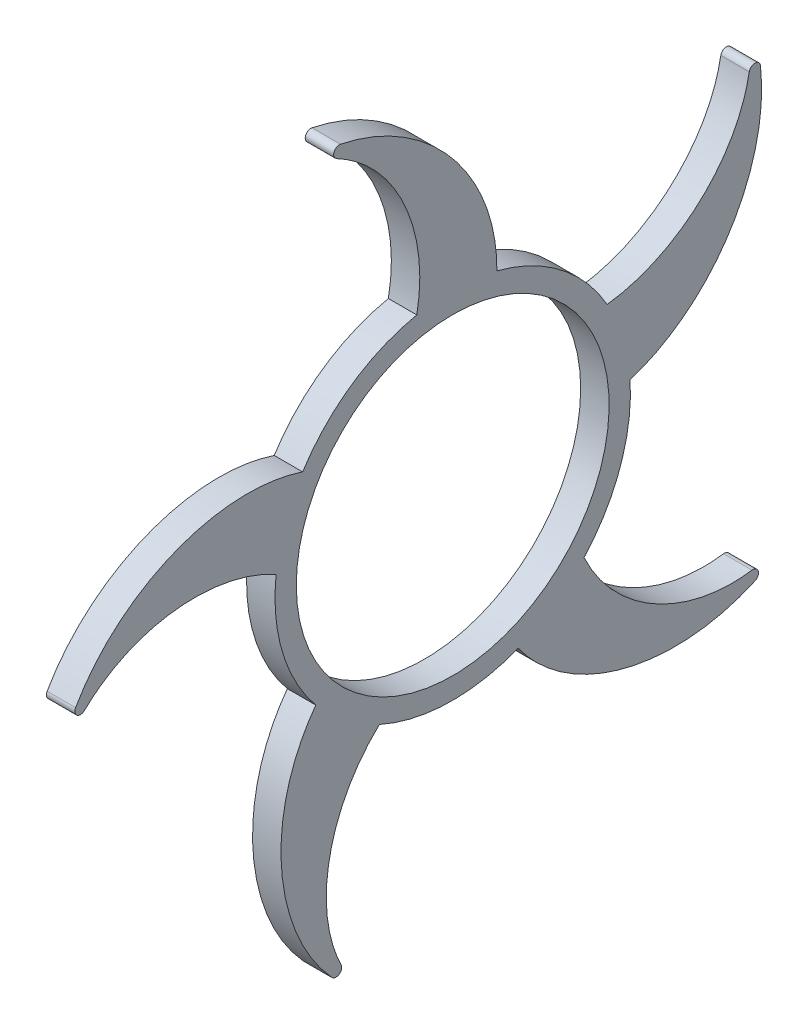
ISO-10303-21;
HEADER;
FILE_DESCRIPTION(('STEP AP214'),'2;1');
FILE_NAME('part.step','',(''),(''),'','','');
FILE_SCHEMA(('AUTOMOTIVE_DESIGN { 1 0 10303 214 1 1 1 1 }'));
ENDSEC;
DATA;
#1=APPLICATION_CONTEXT('core data for automotive mechanical design processes');
#2=APPLICATION_PROTOCOL_DEFINITION('international standard','automotive_design',2000,#1);
#3=PRODUCT_CONTEXT('',#1,'mechanical');
#4=PRODUCT('Part','Part','',(#3));
#5=PRODUCT_RELATED_PRODUCT_CATEGORY('part','',(#4));
#6=PRODUCT_DEFINITION_FORMATION('','',#4);
#7=PRODUCT_DEFINITION_CONTEXT('part definition',#1,'design');
#8=PRODUCT_DEFINITION('design','',#6,#7);
#9=PRODUCT_DEFINITION_SHAPE('','',#8);
#10=(LENGTH_UNIT() NAMED_UNIT(*) SI_UNIT(.MILLI.,.METRE.));
#11=(NAMED_UNIT(*) PLANE_ANGLE_UNIT() SI_UNIT($,.RADIAN.));
#12=(NAMED_UNIT(*) SI_UNIT($,.STERADIAN.) SOLID_ANGLE_UNIT());
#13=UNCERTAINTY_MEASURE_WITH_UNIT(LENGTH_MEASURE(1.E-05),#10,'distance_accuracy_value','');
#14=(GEOMETRIC_REPRESENTATION_CONTEXT(3) GLOBAL_UNCERTAINTY_ASSIGNED_CONTEXT((#13)) GLOBAL_UNIT_ASSIGNED_CONTEXT((#10,
#11,#12)) REPRESENTATION_CONTEXT('',''));
#15=CARTESIAN_POINT('',(0.,0.,0.));
#16=DIRECTION('',(0.,0.,1.));
#17=DIRECTION('',(1.,0.,0.));
#18=AXIS2_PLACEMENT_3D('',#15,#16,#17);
#19=CARTESIAN_POINT('',(-595.,152.866299335935,-212.492633473936));
#20=DIRECTION('',(-1.,0.,0.));
#21=DIRECTION('',(0.,-1.,0.));
#22=AXIS2_PLACEMENT_3D('',#19,#20,#21);
#23=CYLINDRICAL_SURFACE('',#22,4.);
#24=DIRECTION('',(-1.,0.,0.));
#25=VECTOR('',#24,1.);
#26=CARTESIAN_POINT('',(-595.000000000001,153.556516259895,-208.552633398063));
#27=LINE('',#26,#25);
#28=CARTESIAN_POINT('',(-575.,153.556516259895,-208.552633398062));
#29=VERTEX_POINT('',#28);
#30=CARTESIAN_POINT('',(-595.000000000001,153.556516259895,-208.552633398063));
#31=VERTEX_POINT('',#30);
#32=EDGE_CURVE('E11',#29,#31,#27,.T.);
#33=ORIENTED_EDGE('',*,*,#32,.F.);
#34=CARTESIAN_POINT('',(-575.,152.866299335935,-212.492633473936));
#35=DIRECTION('',(-1.,0.,0.));
#36=DIRECTION('',(0.,-1.,0.));
#37=AXIS2_PLACEMENT_3D('',#34,#35,#36);
#38=CIRCLE('',#37,4.);
#39=CARTESIAN_POINT('',(-575.,153.310025435263,-216.467945681646));
#40=VERTEX_POINT('',#39);
#41=EDGE_CURVE('E142',#29,#40,#38,.T.);
#42=ORIENTED_EDGE('',*,*,#41,.T.);
#43=DIRECTION('',(-1.,0.,0.));
#44=VECTOR('',#43,1.);
#45=CARTESIAN_POINT('',(-595.,153.310025435262,-216.467945681647));
#46=LINE('',#45,#44);
#47=CARTESIAN_POINT('',(-595.,153.310025435262,-216.467945681647));
#48=VERTEX_POINT('',#47);
#49=EDGE_CURVE('E47',#40,#48,#46,.T.);
#50=ORIENTED_EDGE('',*,*,#49,.T.);
#51=CARTESIAN_POINT('',(-595.,152.866299335935,-212.492633473936));
#52=DIRECTION('',(-1.,0.,0.));
#53=DIRECTION('',(0.,0.951056516295147,0.309016994374957));
#54=AXIS2_PLACEMENT_3D('',#51,#52,#53);
#55=CIRCLE('',#54,4.);
#56=EDGE_CURVE('E306',#31,#48,#55,.T.);
#57=ORIENTED_EDGE('',*,*,#56,.F.);
#58=EDGE_LOOP('',(#33,#42,#50,#57));
#59=FACE_BOUND('',#58,.T.);
#60=ADVANCED_FACE('F37',(#59),#23,.T.);
#61=CARTESIAN_POINT('',(-595.,184.107288487317,-209.081925450933));
#62=CARTESIAN_POINT('',(-595.000000000001,107.623836917837,-237.903598353965));
#63=CARTESIAN_POINT('',(-594.999999999999,18.1180485550715,-187.291009944743));
#64=CARTESIAN_POINT('',(-595.,4.17158923149674,-109.920870826625));
#65=B_SPLINE_CURVE_WITH_KNOTS('',3,(#61,#62,#63,#64),.UNSPECIFIED.,.F.,.F.,(4,4),(0.,1.),.UNSPECIFIED.);
#66=DIRECTION('',(-1.,0.,0.));
#67=VECTOR('',#66,1.);
#68=SURFACE_OF_LINEAR_EXTRUSION('',#65,#67);
#69=ORIENTED_EDGE('',*,*,#49,.F.);
#70=CARTESIAN_POINT('',(-575.,184.107288487317,-209.081925450933));
#71=CARTESIAN_POINT('',(-575.000000000001,107.623836917837,-237.903598353965));
#72=CARTESIAN_POINT('',(-574.999999999999,18.1180485550715,-187.291009944743));
#73=CARTESIAN_POINT('',(-575.,4.17158923149675,-109.920870826625));
#74=B_SPLINE_CURVE_WITH_KNOTS('',3,(#70,#71,#72,#73),.UNSPECIFIED.,.F.,.F.,(4,4),(0.,1.),.UNSPECIFIED.);
#75=CARTESIAN_POINT('',(-575.,7.85585418656709,-124.752897982369));
#76=VERTEX_POINT('',#75);
#77=EDGE_CURVE('E237',#40,#76,#74,.T.);
#78=ORIENTED_EDGE('',*,*,#77,.T.);
#79=DIRECTION('',(-1.,0.,0.));
#80=VECTOR('',#79,1.);
#81=CARTESIAN_POINT('',(-595.000000000001,7.85585418656565,-124.75289798237));
#82=LINE('',#81,#80);
#83=CARTESIAN_POINT('',(-595.000000000001,7.85585418656565,-124.75289798237));
#84=VERTEX_POINT('',#83);
#85=EDGE_CURVE('E299',#76,#84,#82,.T.);
#86=ORIENTED_EDGE('',*,*,#85,.T.);
#87=EDGE_CURVE('E316',#48,#84,#65,.T.);
#88=ORIENTED_EDGE('',*,*,#87,.F.);
#89=EDGE_LOOP('',(#69,#78,#86,#88));
#90=FACE_BOUND('',#89,.T.);
#91=ADVANCED_FACE('F319',(#90),#68,.T.);
#92=CARTESIAN_POINT('',(-595.,0.,0.));
#93=DIRECTION('',(-1.,0.,0.));
#94=DIRECTION('',(0.,-1.,0.));
#95=AXIS2_PLACEMENT_3D('',#92,#93,#94);
#96=CYLINDRICAL_SURFACE('',#95,125.000000000001);
#97=ORIENTED_EDGE('',*,*,#85,.F.);
#98=CARTESIAN_POINT('',(-575.,0.,0.));
#99=DIRECTION('',(-1.,0.,0.));
#100=DIRECTION('',(0.,-1.,0.));
#101=AXIS2_PLACEMENT_3D('',#98,#99,#100);
#102=CIRCLE('',#101,125.000000000001);
#103=CARTESIAN_POINT('',(-575.,-84.1936169858894,-92.3928290444281));
#104=VERTEX_POINT('',#103);
#105=EDGE_CURVE('E231',#76,#104,#102,.T.);
#106=ORIENTED_EDGE('',*,*,#105,.T.);
#107=DIRECTION('',(-1.,0.,0.));
#108=VECTOR('',#107,1.);
#109=CARTESIAN_POINT('',(-594.999999999999,-84.1936169858916,-92.3928290444288));
#110=LINE('',#109,#108);
#111=CARTESIAN_POINT('',(-594.999999999999,-84.1936169858916,-92.3928290444288));
#112=VERTEX_POINT('',#111);
#113=EDGE_CURVE('E296',#104,#112,#110,.T.);
#114=ORIENTED_EDGE('',*,*,#113,.T.);
#115=CARTESIAN_POINT('',(-595.,0.,0.));
#116=DIRECTION('',(-1.,0.,0.));
#117=DIRECTION('',(0.,-0.999999999999996,0.));
#118=AXIS2_PLACEMENT_3D('',#115,#116,#117);
#119=CIRCLE('',#118,125.000000000001);
#120=EDGE_CURVE('E320',#84,#112,#119,.T.);
#121=ORIENTED_EDGE('',*,*,#120,.F.);
#122=EDGE_LOOP('',(#97,#106,#114,#121));
#123=FACE_BOUND('',#122,.T.);
#124=ADVANCED_FACE('F341',(#123),#96,.T.);
#125=CARTESIAN_POINT('',(-595.,-67.9847533728668,-86.4758539063386));
#126=CARTESIAN_POINT('',(-595.,-129.987693122315,-103.420338607004));
#127=CARTESIAN_POINT('',(-594.999999999999,-171.981368785824,-177.838115875512));
#128=CARTESIAN_POINT('',(-595.,-141.956446708776,-239.706304594268));
#129=B_SPLINE_CURVE_WITH_KNOTS('',3,(#125,#126,#127,#128),.UNSPECIFIED.,.F.,.F.,(4,4),(0.,1.),.UNSPECIFIED.);
#130=DIRECTION('',(-1.,0.,0.));
#131=VECTOR('',#130,1.);
#132=SURFACE_OF_LINEAR_EXTRUSION('',#129,#131);
#133=ORIENTED_EDGE('',*,*,#113,.F.);
#134=CARTESIAN_POINT('',(-575.,-67.9847533728668,-86.4758539063386));
#135=CARTESIAN_POINT('',(-575.,-129.987693122315,-103.420338607004));
#136=CARTESIAN_POINT('',(-574.999999999999,-171.981368785824,-177.838115875512));
#137=CARTESIAN_POINT('',(-575.,-141.956446708776,-239.706304594268));
#138=B_SPLINE_CURVE_WITH_KNOTS('',3,(#134,#135,#136,#137),.UNSPECIFIED.,.F.,.F.,(4,4),(0.,1.),.UNSPECIFIED.);
#139=CARTESIAN_POINT('',(-575.,-150.89376786242,-210.487233350204));
#140=VERTEX_POINT('',#139);
#141=EDGE_CURVE('E226',#104,#140,#138,.T.);
#142=ORIENTED_EDGE('',*,*,#141,.T.);
#143=DIRECTION('',(-1.,0.,0.));
#144=VECTOR('',#143,1.);
#145=CARTESIAN_POINT('',(-595.,-150.893767862422,-210.487233350206));
#146=LINE('',#145,#144);
#147=CARTESIAN_POINT('',(-595.,-150.893767862422,-210.487233350206));
#148=VERTEX_POINT('',#147);
#149=EDGE_CURVE('E293',#140,#148,#146,.T.);
#150=ORIENTED_EDGE('',*,*,#149,.T.);
#151=EDGE_CURVE('E322',#112,#148,#129,.T.);
#152=ORIENTED_EDGE('',*,*,#151,.F.);
#153=EDGE_LOOP('',(#133,#142,#150,#152));
#154=FACE_BOUND('',#153,.T.);
#155=ADVANCED_FACE('F342',(#154),#132,.T.);
#156=CARTESIAN_POINT('',(-595.000000000001,-154.854219368093,-211.0483250283));
#157=DIRECTION('',(-1.,0.,0.));
#158=DIRECTION('',(0.,-1.,0.));
#159=AXIS2_PLACEMENT_3D('',#156,#157,#158);
#160=CYLINDRICAL_SURFACE('',#159,4.);
#161=ORIENTED_EDGE('',*,*,#149,.F.);
#162=CARTESIAN_POINT('',(-575.000000000001,-154.854219368093,-211.0483250283));
#163=DIRECTION('',(-1.,0.,0.));
#164=DIRECTION('',(0.,-1.,0.));
#165=AXIS2_PLACEMENT_3D('',#162,#163,#164);
#166=CIRCLE('',#165,4.);
#167=CARTESIAN_POINT('',(-575.,-158.497847042002,-212.698772656642));
#168=VERTEX_POINT('',#167);
#169=EDGE_CURVE('E220',#140,#168,#166,.T.);
#170=ORIENTED_EDGE('',*,*,#169,.T.);
#171=DIRECTION('',(-1.,0.,0.));
#172=VECTOR('',#171,1.);
#173=CARTESIAN_POINT('',(-595.,-158.497847042005,-212.698772656644));
#174=LINE('',#173,#172);
#175=CARTESIAN_POINT('',(-595.,-158.497847042005,-212.698772656644));
#176=VERTEX_POINT('',#175);
#177=EDGE_CURVE('E290',#168,#176,#174,.T.);
#178=ORIENTED_EDGE('',*,*,#177,.T.);
#179=CARTESIAN_POINT('',(-595.000000000001,-154.854219368093,-211.0483250283));
#180=DIRECTION('',(-1.,0.,0.));
#181=DIRECTION('',(0.,0.587785252292478,-0.80901699437494));
#182=AXIS2_PLACEMENT_3D('',#179,#180,#181);
#183=CIRCLE('',#182,4.);
#184=EDGE_CURVE('E387',#148,#176,#183,.T.);
#185=ORIENTED_EDGE('',*,*,#184,.F.);
#186=EDGE_LOOP('',(#161,#170,#178,#185));
#187=FACE_BOUND('',#186,.T.);
#188=ADVANCED_FACE('F407',(#187),#160,.T.);
#189=CARTESIAN_POINT('',(-595.,-141.956446708776,-239.706304594268));
#190=CARTESIAN_POINT('',(-595.,-193.002172857155,-175.872606323722));
#191=CARTESIAN_POINT('',(-595.,-172.525550543021,-75.1073931074256));
#192=CARTESIAN_POINT('',(-595.000000000001,-103.251868510416,-37.9348342438424));
#193=B_SPLINE_CURVE_WITH_KNOTS('',3,(#189,#190,#191,#192),.UNSPECIFIED.,.F.,.F.,(4,4),(0.,1.),.UNSPECIFIED.);
#194=DIRECTION('',(-1.,0.,0.));
#195=VECTOR('',#194,1.);
#196=SURFACE_OF_LINEAR_EXTRUSION('',#193,#195);
#197=ORIENTED_EDGE('',*,*,#177,.F.);
#198=CARTESIAN_POINT('',(-575.,-141.956446708776,-239.706304594268));
#199=CARTESIAN_POINT('',(-575.,-193.002172857155,-175.872606323722));
#200=CARTESIAN_POINT('',(-575.,-172.525550543021,-75.1073931074256));
#201=CARTESIAN_POINT('',(-575.000000000001,-103.251868510416,-37.9348342438424));
#202=B_SPLINE_CURVE_WITH_KNOTS('',3,(#198,#199,#200,#201),.UNSPECIFIED.,.F.,.F.,(4,4),(0.,1.),.UNSPECIFIED.);
#203=CARTESIAN_POINT('',(-575.,-116.219464103855,-46.0221268892738));
#204=VERTEX_POINT('',#203);
#205=EDGE_CURVE('E215',#168,#204,#202,.T.);
#206=ORIENTED_EDGE('',*,*,#205,.T.);
#207=DIRECTION('',(-1.,0.,0.));
#208=VECTOR('',#207,1.);
#209=CARTESIAN_POINT('',(-594.999999999999,-116.219464103857,-46.0221268892742));
#210=LINE('',#209,#208);
#211=CARTESIAN_POINT('',(-594.999999999999,-116.219464103857,-46.0221268892742));
#212=VERTEX_POINT('',#211);
#213=EDGE_CURVE('E287',#204,#212,#210,.T.);
#214=ORIENTED_EDGE('',*,*,#213,.T.);
#215=EDGE_CURVE('E380',#176,#212,#193,.T.);
#216=ORIENTED_EDGE('',*,*,#215,.F.);
#217=EDGE_LOOP('',(#197,#206,#214,#216));
#218=FACE_BOUND('',#217,.T.);
#219=ADVANCED_FACE('F403',(#218),#196,.T.);
#220=ORIENTED_EDGE('',*,*,#213,.F.);
#221=CARTESIAN_POINT('',(-575.,0.,0.));
#222=DIRECTION('',(-1.,0.,0.));
#223=DIRECTION('',(0.,-1.,0.));
#224=AXIS2_PLACEMENT_3D('',#221,#222,#223);
#225=CIRCLE('',#224,125.000000000001);
#226=CARTESIAN_POINT('',(-575.,-113.888060588181,51.5219337317824));
#227=VERTEX_POINT('',#226);
#228=EDGE_CURVE('E209',#204,#227,#225,.T.);
#229=ORIENTED_EDGE('',*,*,#228,.T.);
#230=DIRECTION('',(-1.,0.,0.));
#231=VECTOR('',#230,1.);
#232=CARTESIAN_POINT('',(-595.,-113.888060588184,51.5219337317828));
#233=LINE('',#232,#231);
#234=CARTESIAN_POINT('',(-595.,-113.888060588184,51.5219337317828));
#235=VERTEX_POINT('',#234);
#236=EDGE_CURVE('E284',#227,#235,#233,.T.);
#237=ORIENTED_EDGE('',*,*,#236,.T.);
#238=EDGE_CURVE('E324',#212,#235,#119,.T.);
#239=ORIENTED_EDGE('',*,*,#238,.F.);
#240=EDGE_LOOP('',(#220,#229,#237,#239));
#241=FACE_BOUND('',#240,.T.);
#242=ADVANCED_FACE('F406',(#241),#96,.T.);
#243=CARTESIAN_POINT('',(-595.,-103.251868510416,37.9348342438401));
#244=CARTESIAN_POINT('',(-595.000000000001,-138.526993184034,91.6670003885763));
#245=CARTESIAN_POINT('',(-595.000000000001,-222.279264619743,108.609001411964));
#246=CARTESIAN_POINT('',(-595.,-271.841197475503,60.9352818940407));
#247=B_SPLINE_CURVE_WITH_KNOTS('',3,(#243,#244,#245,#246),.UNSPECIFIED.,.F.,.F.,(4,4),(0.,1.),.UNSPECIFIED.);
#248=DIRECTION('',(-1.,0.,0.));
#249=VECTOR('',#248,1.);
#250=SURFACE_OF_LINEAR_EXTRUSION('',#247,#249);
#251=ORIENTED_EDGE('',*,*,#236,.F.);
#252=CARTESIAN_POINT('',(-575.,-103.251868510416,37.9348342438401));
#253=CARTESIAN_POINT('',(-575.000000000001,-138.526993184034,91.6670003885763));
#254=CARTESIAN_POINT('',(-575.000000000001,-222.279264619743,108.609001411964));
#255=CARTESIAN_POINT('',(-575.,-271.841197475503,60.9352818940407));
#256=B_SPLINE_CURVE_WITH_KNOTS('',3,(#252,#253,#254,#255),.UNSPECIFIED.,.F.,.F.,(4,4),(0.,1.),.UNSPECIFIED.);
#257=CARTESIAN_POINT('',(-575.,-246.813993489405,78.4643689897062));
#258=VERTEX_POINT('',#257);
#259=EDGE_CURVE('E204',#227,#258,#256,.T.);
#260=ORIENTED_EDGE('',*,*,#259,.T.);
#261=DIRECTION('',(-1.,0.,0.));
#262=VECTOR('',#261,1.);
#263=CARTESIAN_POINT('',(-594.999999999999,-246.813993489408,78.4643689897068));
#264=LINE('',#263,#262);
#265=CARTESIAN_POINT('',(-594.999999999999,-246.813993489408,78.4643689897068));
#266=VERTEX_POINT('',#265);
#267=EDGE_CURVE('E281',#258,#266,#264,.T.);
#268=ORIENTED_EDGE('',*,*,#267,.T.);
#269=EDGE_CURVE('E379',#235,#266,#247,.T.);
#270=ORIENTED_EDGE('',*,*,#269,.F.);
#271=EDGE_LOOP('',(#251,#260,#268,#270));
#272=FACE_BOUND('',#271,.T.);
#273=ADVANCED_FACE('F409',(#272),#250,.T.);
#274=CARTESIAN_POINT('',(-594.999999999999,-248.571470206749,82.0575953377128));
#275=DIRECTION('',(-1.,0.,0.));
#276=DIRECTION('',(0.,-1.,0.));
#277=AXIS2_PLACEMENT_3D('',#274,#275,#276);
#278=CYLINDRICAL_SURFACE('',#277,4.);
#279=ORIENTED_EDGE('',*,*,#267,.F.);
#280=CARTESIAN_POINT('',(-574.999999999999,-248.571470206749,82.0575953377128));
#281=DIRECTION('',(-1.,0.,0.));
#282=DIRECTION('',(0.,-1.,0.));
#283=AXIS2_PLACEMENT_3D('',#280,#281,#282);
#284=CIRCLE('',#283,4.);
#285=CARTESIAN_POINT('',(-575.,-251.267082050899,85.0128748144552));
#286=VERTEX_POINT('',#285);
#287=EDGE_CURVE('E198',#258,#286,#284,.T.);
#288=ORIENTED_EDGE('',*,*,#287,.T.);
#289=DIRECTION('',(-1.,0.,0.));
#290=VECTOR('',#289,1.);
#291=CARTESIAN_POINT('',(-595.,-251.267082050903,85.0128748144557));
#292=LINE('',#291,#290);
#293=CARTESIAN_POINT('',(-595.,-251.267082050903,85.0128748144557));
#294=VERTEX_POINT('',#293);
#295=EDGE_CURVE('E278',#286,#294,#292,.T.);
#296=ORIENTED_EDGE('',*,*,#295,.T.);
#297=CARTESIAN_POINT('',(-594.999999999999,-248.571470206749,82.0575953377128));
#298=DIRECTION('',(-1.,0.,0.));
#299=DIRECTION('',(0.,-0.587785252292466,-0.809016994374949));
#300=AXIS2_PLACEMENT_3D('',#297,#298,#299);
#301=CIRCLE('',#300,4.);
#302=EDGE_CURVE('E376',#266,#294,#301,.T.);
#303=ORIENTED_EDGE('',*,*,#302,.F.);
#304=EDGE_LOOP('',(#279,#288,#296,#303));
#305=FACE_BOUND('',#304,.T.);
#306=ADVANCED_FACE('F509',(#305),#278,.T.);
#307=CARTESIAN_POINT('',(-595.,-271.841197475503,60.9352818940407));
#308=CARTESIAN_POINT('',(-595.,-226.90573964614,129.208349955876));
#309=CARTESIAN_POINT('',(-595.,-124.744702718446,140.872088197955));
#310=CARTESIAN_POINT('',(-595.,-67.9847533728687,86.4758539063373));
#311=B_SPLINE_CURVE_WITH_KNOTS('',3,(#307,#308,#309,#310),.UNSPECIFIED.,.F.,.F.,(4,4),(0.,1.),.UNSPECIFIED.);
#312=DIRECTION('',(-1.,0.,0.));
#313=VECTOR('',#312,1.);
#314=SURFACE_OF_LINEAR_EXTRUSION('',#311,#313);
#315=ORIENTED_EDGE('',*,*,#295,.F.);
#316=CARTESIAN_POINT('',(-575.,-271.841197475503,60.9352818940407));
#317=CARTESIAN_POINT('',(-575.,-226.90573964614,129.208349955876));
#318=CARTESIAN_POINT('',(-575.,-124.744702718446,140.872088197955));
#319=CARTESIAN_POINT('',(-575.,-67.9847533728687,86.4758539063373));
#320=B_SPLINE_CURVE_WITH_KNOTS('',3,(#316,#317,#318,#319),.UNSPECIFIED.,.F.,.F.,(4,4),(0.,1.),.UNSPECIFIED.);
#321=CARTESIAN_POINT('',(-575.,-79.683433157045,96.3096593302374));
#322=VERTEX_POINT('',#321);
#323=EDGE_CURVE('E193',#286,#322,#320,.T.);
#324=ORIENTED_EDGE('',*,*,#323,.T.);
#325=DIRECTION('',(-1.,0.,0.));
#326=VECTOR('',#325,1.);
#327=CARTESIAN_POINT('',(-595.000000000001,-79.6834331570471,96.309659330238));
#328=LINE('',#327,#326);
#329=CARTESIAN_POINT('',(-595.000000000001,-79.6834331570471,96.309659330238));
#330=VERTEX_POINT('',#329);
#331=EDGE_CURVE('E275',#322,#330,#328,.T.);
#332=ORIENTED_EDGE('',*,*,#331,.T.);
#333=EDGE_CURVE('E369',#294,#330,#311,.T.);
#334=ORIENTED_EDGE('',*,*,#333,.F.);
#335=EDGE_LOOP('',(#315,#324,#332,#334));
#336=FACE_BOUND('',#335,.T.);
#337=ADVANCED_FACE('F507',(#336),#314,.T.);
#338=ORIENTED_EDGE('',*,*,#331,.F.);
#339=CARTESIAN_POINT('',(-575.,0.,0.));
#340=DIRECTION('',(-1.,0.,0.));
#341=DIRECTION('',(0.,-1.,0.));
#342=AXIS2_PLACEMENT_3D('',#339,#340,#341);
#343=CIRCLE('',#342,125.000000000001);
#344=CARTESIAN_POINT('',(-575.,13.8069246295885,124.235135256789));
#345=VERTEX_POINT('',#344);
#346=EDGE_CURVE('E187',#322,#345,#343,.T.);
#347=ORIENTED_EDGE('',*,*,#346,.T.);
#348=DIRECTION('',(-1.,0.,0.));
#349=VECTOR('',#348,1.);
#350=CARTESIAN_POINT('',(-595.000000000001,13.8069246295871,124.23513525679));
#351=LINE('',#350,#349);
#352=CARTESIAN_POINT('',(-595.000000000001,13.8069246295871,124.23513525679));
#353=VERTEX_POINT('',#352);
#354=EDGE_CURVE('E272',#345,#353,#351,.T.);
#355=ORIENTED_EDGE('',*,*,#354,.T.);
#356=EDGE_CURVE('E357',#330,#353,#119,.T.);
#357=ORIENTED_EDGE('',*,*,#356,.F.);
#358=EDGE_LOOP('',(#338,#347,#355,#357));
#359=FACE_BOUND('',#358,.T.);
#360=ADVANCED_FACE('F505',(#359),#96,.T.);
#361=CARTESIAN_POINT('',(-595.,4.17158923149485,109.920870826625));
#362=CARTESIAN_POINT('',(-595.,44.3733029752581,160.073660493894));
#363=CARTESIAN_POINT('',(-595.,34.6052282564917,244.962170232291));
#364=CARTESIAN_POINT('',(-595.,-26.0506528735559,277.366379918841));
#365=B_SPLINE_CURVE_WITH_KNOTS('',3,(#361,#362,#363,#364),.UNSPECIFIED.,.F.,.F.,(4,4),(0.,1.),.UNSPECIFIED.);
#366=DIRECTION('',(-1.,0.,0.));
#367=VECTOR('',#366,1.);
#368=SURFACE_OF_LINEAR_EXTRUSION('',#365,#367);
#369=ORIENTED_EDGE('',*,*,#354,.F.);
#370=CARTESIAN_POINT('',(-575.,4.17158923149486,109.920870826625));
#371=CARTESIAN_POINT('',(-575.,44.3733029752581,160.073660493894));
#372=CARTESIAN_POINT('',(-575.,34.6052282564917,244.962170232291));
#373=CARTESIAN_POINT('',(-575.,-26.0506528735559,277.366379918841));
#374=B_SPLINE_CURVE_WITH_KNOTS('',3,(#370,#371,#372,#373),.UNSPECIFIED.,.F.,.F.,(4,4),(0.,1.),.UNSPECIFIED.);
#375=CARTESIAN_POINT('',(-575.,-1.64566901312463,258.980880291655));
#376=VERTEX_POINT('',#375);
#377=EDGE_CURVE('E182',#345,#376,#374,.T.);
#378=ORIENTED_EDGE('',*,*,#377,.T.);
#379=DIRECTION('',(-1.,0.,0.));
#380=VECTOR('',#379,1.);
#381=CARTESIAN_POINT('',(-595.000000000001,-1.64566901312613,258.980880291657));
#382=LINE('',#381,#380);
#383=CARTESIAN_POINT('',(-595.000000000001,-1.64566901312613,258.980880291657));
#384=VERTEX_POINT('',#383);
#385=EDGE_CURVE('E269',#376,#384,#382,.T.);
#386=ORIENTED_EDGE('',*,*,#385,.T.);
#387=EDGE_CURVE('E368',#353,#384,#365,.T.);
#388=ORIENTED_EDGE('',*,*,#387,.F.);
#389=EDGE_LOOP('',(#369,#378,#386,#388));
#390=FACE_BOUND('',#389,.T.);
#391=ADVANCED_FACE('F502',(#390),#368,.T.);
#392=CARTESIAN_POINT('',(-595.,1.22860214679188,261.762707982091));
#393=DIRECTION('',(-1.,0.,0.));
#394=DIRECTION('',(0.,-1.,0.));
#395=AXIS2_PLACEMENT_3D('',#392,#393,#394);
#396=CYLINDRICAL_SURFACE('',#395,4.);
#397=ORIENTED_EDGE('',*,*,#385,.F.);
#398=CARTESIAN_POINT('',(-575.,1.22860214679188,261.762707982091));
#399=DIRECTION('',(-1.,0.,0.));
#400=DIRECTION('',(0.,-1.,0.));
#401=AXIS2_PLACEMENT_3D('',#398,#399,#400);
#402=CIRCLE('',#401,4.);
#403=CARTESIAN_POINT('',(-575.,3.20625008054115,265.239618773315));
#404=VERTEX_POINT('',#403);
#405=EDGE_CURVE('E176',#376,#404,#402,.T.);
#406=ORIENTED_EDGE('',*,*,#405,.T.);
#407=DIRECTION('',(-1.,0.,0.));
#408=VECTOR('',#407,1.);
#409=CARTESIAN_POINT('',(-595.,3.20625008053965,265.239618773316));
#410=LINE('',#409,#408);
#411=CARTESIAN_POINT('',(-595.,3.20625008053965,265.239618773316));
#412=VERTEX_POINT('',#411);
#413=EDGE_CURVE('E266',#404,#412,#410,.T.);
#414=ORIENTED_EDGE('',*,*,#413,.T.);
#415=CARTESIAN_POINT('',(-595.,1.22860214679188,261.762707982091));
#416=DIRECTION('',(-1.,0.,0.));
#417=DIRECTION('',(0.,-0.951056516295152,0.309016994374944));
#418=AXIS2_PLACEMENT_3D('',#415,#416,#417);
#419=CIRCLE('',#418,4.);
#420=EDGE_CURVE('E365',#384,#412,#419,.T.);
#421=ORIENTED_EDGE('',*,*,#420,.F.);
#422=EDGE_LOOP('',(#397,#406,#414,#421));
#423=FACE_BOUND('',#422,.T.);
#424=ADVANCED_FACE('F482',(#423),#396,.T.);
#425=CARTESIAN_POINT('',(-595.,-26.0506528735559,277.366379918841));
#426=CARTESIAN_POINT('',(-595.000000000001,52.7667135134067,255.727758226744));
#427=CARTESIAN_POINT('',(-595.,95.4290843465206,162.171131679934));
#428=CARTESIAN_POINT('',(-595.,61.2349802092041,91.3798511641282));
#429=B_SPLINE_CURVE_WITH_KNOTS('',3,(#425,#426,#427,#428),.UNSPECIFIED.,.F.,.F.,(4,4),(0.,1.),.UNSPECIFIED.);
#430=DIRECTION('',(-1.,0.,0.));
#431=VECTOR('',#430,1.);
#432=SURFACE_OF_LINEAR_EXTRUSION('',#429,#431);
#433=ORIENTED_EDGE('',*,*,#413,.F.);
#434=CARTESIAN_POINT('',(-575.,-26.0506528735559,277.366379918841));
#435=CARTESIAN_POINT('',(-575.000000000001,52.7667135134067,255.727758226744));
#436=CARTESIAN_POINT('',(-575.,95.4290843465206,162.171131679934));
#437=CARTESIAN_POINT('',(-575.,61.2349802092042,91.3798511641282));
#438=B_SPLINE_CURVE_WITH_KNOTS('',3,(#434,#435,#436,#437),.UNSPECIFIED.,.F.,.F.,(4,4),(0.,1.),.UNSPECIFIED.);
#439=CARTESIAN_POINT('',(-575.,66.9723940725226,105.544769800283));
#440=VERTEX_POINT('',#439);
#441=EDGE_CURVE('E171',#404,#440,#438,.T.);
#442=ORIENTED_EDGE('',*,*,#441,.T.);
#443=DIRECTION('',(-1.,0.,0.));
#444=VECTOR('',#443,1.);
#445=CARTESIAN_POINT('',(-595.,66.9723940725217,105.544769800284));
#446=LINE('',#445,#444);
#447=CARTESIAN_POINT('',(-595.,66.9723940725217,105.544769800284));
#448=VERTEX_POINT('',#447);
#449=EDGE_CURVE('E263',#440,#448,#446,.T.);
#450=ORIENTED_EDGE('',*,*,#449,.T.);
#451=EDGE_CURVE('E356',#412,#448,#429,.T.);
#452=ORIENTED_EDGE('',*,*,#451,.F.);
#453=EDGE_LOOP('',(#433,#442,#450,#452));
#454=FACE_BOUND('',#453,.T.);
#455=ADVANCED_FACE('F479',(#454),#432,.T.);
#456=ORIENTED_EDGE('',*,*,#449,.F.);
#457=CARTESIAN_POINT('',(-575.,0.,0.));
#458=DIRECTION('',(-1.,0.,0.));
#459=DIRECTION('',(0.,-1.,0.));
#460=AXIS2_PLACEMENT_3D('',#457,#458,#459);
#461=CIRCLE('',#460,125.000000000001);
#462=CARTESIAN_POINT('',(-575.,122.421209289377,25.2596024538527));
#463=VERTEX_POINT('',#462);
#464=EDGE_CURVE('E165',#440,#463,#461,.T.);
#465=ORIENTED_EDGE('',*,*,#464,.T.);
#466=DIRECTION('',(-1.,0.,0.));
#467=VECTOR('',#466,1.);
#468=CARTESIAN_POINT('',(-595.,122.421209289377,25.2596024538528));
#469=LINE('',#468,#467);
#470=CARTESIAN_POINT('',(-595.,122.421209289377,25.2596024538528));
#471=VERTEX_POINT('',#470);
#472=EDGE_CURVE('E260',#463,#471,#469,.T.);
#473=ORIENTED_EDGE('',*,*,#472,.T.);
#474=EDGE_CURVE('E352',#448,#471,#119,.T.);
#475=ORIENTED_EDGE('',*,*,#474,.F.);
#476=EDGE_LOOP('',(#456,#465,#473,#475));
#477=FACE_BOUND('',#476,.T.);
#478=ADVANCED_FACE('F478',(#477),#96,.T.);
#479=CARTESIAN_POINT('',(-595.,105.830052442583,29.9999999999998));
#480=CARTESIAN_POINT('',(-595.,165.951202615839,7.2639625002604));
#481=CARTESIAN_POINT('',(-595.,243.666471870703,42.7859457495284));
#482=CARTESIAN_POINT('',(-595.,255.74100857052,110.486568232318));
#483=B_SPLINE_CURVE_WITH_KNOTS('',3,(#479,#480,#481,#482),.UNSPECIFIED.,.F.,.F.,(4,4),(0.,1.),.UNSPECIFIED.);
#484=DIRECTION('',(-1.,0.,0.));
#485=VECTOR('',#484,1.);
#486=SURFACE_OF_LINEAR_EXTRUSION('',#483,#485);
#487=ORIENTED_EDGE('',*,*,#472,.F.);
#488=CARTESIAN_POINT('',(-575.,105.830052442583,29.9999999999998));
#489=CARTESIAN_POINT('',(-575.,165.951202615839,7.2639625002604));
#490=CARTESIAN_POINT('',(-575.,243.666471870703,42.7859457495284));
#491=CARTESIAN_POINT('',(-575.,255.74100857052,110.486568232318));
#492=B_SPLINE_CURVE_WITH_KNOTS('',3,(#488,#489,#490,#491),.UNSPECIFIED.,.F.,.F.,(4,4),(0.,1.),.UNSPECIFIED.);
#493=CARTESIAN_POINT('',(-575.,245.796914105064,81.5946174669031));
#494=VERTEX_POINT('',#493);
#495=EDGE_CURVE('E160',#463,#494,#492,.T.);
#496=ORIENTED_EDGE('',*,*,#495,.T.);
#497=DIRECTION('',(-1.,0.,0.));
#498=VECTOR('',#497,1.);
#499=CARTESIAN_POINT('',(-595.,245.796914105064,81.5946174669037));
#500=LINE('',#499,#498);
#501=CARTESIAN_POINT('',(-595.,245.796914105064,81.5946174669037));
#502=VERTEX_POINT('',#501);
#503=EDGE_CURVE('E257',#494,#502,#500,.T.);
#504=ORIENTED_EDGE('',*,*,#503,.T.);
#505=EDGE_CURVE('E355',#471,#502,#483,.T.);
#506=ORIENTED_EDGE('',*,*,#505,.F.);
#507=EDGE_LOOP('',(#487,#496,#504,#506));
#508=FACE_BOUND('',#507,.T.);
#509=ADVANCED_FACE('F450',(#508),#486,.T.);
#510=CARTESIAN_POINT('',(-595.,249.330788092117,79.7206551824312));
#511=DIRECTION('',(-1.,0.,0.));
#512=DIRECTION('',(0.,-1.,0.));
#513=AXIS2_PLACEMENT_3D('',#510,#511,#512);
#514=CYLINDRICAL_SURFACE('',#513,4.);
#515=ORIENTED_EDGE('',*,*,#503,.F.);
#516=CARTESIAN_POINT('',(-575.,249.330788092117,79.7206551824312));
#517=DIRECTION('',(-1.,0.,0.));
#518=DIRECTION('',(0.,-1.,0.));
#519=AXIS2_PLACEMENT_3D('',#516,#517,#518);
#520=CIRCLE('',#519,4.);
#521=CARTESIAN_POINT('',(-575.,253.248653577108,78.9142247505166));
#522=VERTEX_POINT('',#521);
#523=EDGE_CURVE('E154',#494,#522,#520,.T.);
#524=ORIENTED_EDGE('',*,*,#523,.T.);
#525=DIRECTION('',(-1.,0.,0.));
#526=VECTOR('',#525,1.);
#527=CARTESIAN_POINT('',(-595.,253.248653577108,78.9142247505171));
#528=LINE('',#527,#526);
#529=CARTESIAN_POINT('',(-595.,253.248653577108,78.9142247505171));
#530=VERTEX_POINT('',#529);
#531=EDGE_CURVE('E255',#522,#530,#528,.T.);
#532=ORIENTED_EDGE('',*,*,#531,.T.);
#533=CARTESIAN_POINT('',(-595.,249.330788092117,79.7206551824312));
#534=DIRECTION('',(-1.,0.,0.));
#535=DIRECTION('',(0.,0.,0.999999999999996));
#536=AXIS2_PLACEMENT_3D('',#533,#534,#535);
#537=CIRCLE('',#536,4.);
#538=EDGE_CURVE('E363',#502,#530,#537,.T.);
#539=ORIENTED_EDGE('',*,*,#538,.F.);
#540=EDGE_LOOP('',(#515,#524,#532,#539));
#541=FACE_BOUND('',#540,.T.);
#542=ADVANCED_FACE('F456',(#541),#514,.T.);
#543=CARTESIAN_POINT('',(-595.,255.74100857052,110.486568232318));
#544=CARTESIAN_POINT('',(-595.,259.517362072053,28.8400964950658));
#545=CARTESIAN_POINT('',(-595.,183.723120359875,-40.6448168257223));
#546=CARTESIAN_POINT('',(-595.,105.830052442583,-30.));
#547=B_SPLINE_CURVE_WITH_KNOTS('',3,(#543,#544,#545,#546),.UNSPECIFIED.,.F.,.F.,(4,4),(0.,1.),.UNSPECIFIED.);
#548=DIRECTION('',(-1.,0.,0.));
#549=VECTOR('',#548,1.);
#550=SURFACE_OF_LINEAR_EXTRUSION('',#547,#549);
#551=ORIENTED_EDGE('',*,*,#531,.F.);
#552=CARTESIAN_POINT('',(-575.,255.74100857052,110.486568232318));
#553=CARTESIAN_POINT('',(-575.,259.517362072053,28.8400964950658));
#554=CARTESIAN_POINT('',(-575.,183.723120359875,-40.6448168257223));
#555=CARTESIAN_POINT('',(-575.,105.830052442583,-30.));
#556=B_SPLINE_CURVE_WITH_KNOTS('',3,(#552,#553,#554,#555),.UNSPECIFIED.,.F.,.F.,(4,4),(0.,1.),.UNSPECIFIED.);
#557=CARTESIAN_POINT('',(-575.,121.074649001817,-31.0794042588795));
#558=VERTEX_POINT('',#557);
#559=EDGE_CURVE('E149',#522,#558,#556,.T.);
#560=ORIENTED_EDGE('',*,*,#559,.T.);
#561=DIRECTION('',(-1.,0.,0.));
#562=VECTOR('',#561,1.);
#563=CARTESIAN_POINT('',(-595.,121.074649001817,-31.0794042588798));
#564=LINE('',#563,#562);
#565=CARTESIAN_POINT('',(-595.,121.074649001817,-31.0794042588798));
#566=VERTEX_POINT('',#565);
#567=EDGE_CURVE('E55',#558,#566,#564,.T.);
#568=ORIENTED_EDGE('',*,*,#567,.T.);
#569=EDGE_CURVE('E457',#530,#566,#547,.T.);
#570=ORIENTED_EDGE('',*,*,#569,.F.);
#571=EDGE_LOOP('',(#551,#560,#568,#570));
#572=FACE_BOUND('',#571,.T.);
#573=ADVANCED_FACE('F469',(#572),#550,.T.);
#574=ORIENTED_EDGE('',*,*,#567,.F.);
#575=CARTESIAN_POINT('',(-575.,0.,0.));
#576=DIRECTION('',(-1.,0.,0.));
#577=DIRECTION('',(0.,-1.,0.));
#578=AXIS2_PLACEMENT_3D('',#575,#576,#577);
#579=CIRCLE('',#578,125.000000000001);
#580=CARTESIAN_POINT('',(-575.,61.8535436551137,-108.623842397997));
#581=VERTEX_POINT('',#580);
#582=EDGE_CURVE('E140',#558,#581,#579,.T.);
#583=ORIENTED_EDGE('',*,*,#582,.T.);
#584=DIRECTION('',(-1.,0.,0.));
#585=VECTOR('',#584,1.);
#586=CARTESIAN_POINT('',(-595.,61.8535436551126,-108.623842397998));
#587=LINE('',#586,#585);
#588=CARTESIAN_POINT('',(-595.,61.8535436551126,-108.623842397998));
#589=VERTEX_POINT('',#588);
#590=EDGE_CURVE('E41',#581,#589,#587,.T.);
#591=ORIENTED_EDGE('',*,*,#590,.T.);
#592=EDGE_CURVE('E253',#566,#589,#119,.T.);
#593=ORIENTED_EDGE('',*,*,#592,.F.);
#594=EDGE_LOOP('',(#574,#583,#591,#593));
#595=FACE_BOUND('',#594,.T.);
#596=ADVANCED_FACE('F144',(#595),#96,.T.);
#597=CARTESIAN_POINT('',(-595.,61.2349802092058,-91.3798511641277));
#598=CARTESIAN_POINT('',(-595.000000000001,58.1901807152525,-155.584284775728));
#599=CARTESIAN_POINT('',(-595.,115.988933278374,-218.519001518272));
#600=CARTESIAN_POINT('',(-595.,184.107288487317,-209.081925450933));
#601=B_SPLINE_CURVE_WITH_KNOTS('',3,(#597,#598,#599,#600),.UNSPECIFIED.,.F.,.F.,(4,4),(0.,1.),.UNSPECIFIED.);
#602=DIRECTION('',(-1.,0.,0.));
#603=VECTOR('',#602,1.);
#604=SURFACE_OF_LINEAR_EXTRUSION('',#601,#603);
#605=CARTESIAN_POINT('',(-575.,61.2349802092058,-91.3798511641277));
#606=CARTESIAN_POINT('',(-575.000000000001,58.1901807152525,-155.584284775728));
#607=CARTESIAN_POINT('',(-575.,115.988933278374,-218.519001518272));
#608=CARTESIAN_POINT('',(-575.,184.107288487317,-209.081925450933));
#609=B_SPLINE_CURVE_WITH_KNOTS('',3,(#605,#606,#607,#608),.UNSPECIFIED.,.F.,.F.,(4,4),(0.,1.),.UNSPECIFIED.);
#610=EDGE_CURVE('E128',#581,#29,#609,.T.);
#611=ORIENTED_EDGE('',*,*,#610,.T.);
#612=ORIENTED_EDGE('',*,*,#32,.T.);
#613=EDGE_CURVE('E130',#589,#31,#601,.T.);
#614=ORIENTED_EDGE('',*,*,#613,.F.);
#615=ORIENTED_EDGE('',*,*,#590,.F.);
#616=EDGE_LOOP('',(#611,#612,#614,#615));
#617=FACE_BOUND('',#616,.T.);
#618=ADVANCED_FACE('F127',(#617),#604,.T.);
#619=CARTESIAN_POINT('',(-595.,0.,0.));
#620=DIRECTION('',(-1.,0.,0.));
#621=DIRECTION('',(0.,-1.,0.));
#622=AXIS2_PLACEMENT_3D('',#619,#620,#621);
#623=CYLINDRICAL_SURFACE('',#622,110.);
#624=CARTESIAN_POINT('',(-595.,0.,0.));
#625=DIRECTION('',(1.,0.,0.));
#626=DIRECTION('',(0.,0.,0.999999999999996));
#627=AXIS2_PLACEMENT_3D('',#624,#625,#626);
#628=CIRCLE('',#627,110.);
#629=CARTESIAN_POINT('',(-595.,0.,110.));
#630=VERTEX_POINT('',#629);
#631=EDGE_CURVE('E134',#630,#630,#628,.T.);
#632=ORIENTED_EDGE('',*,*,#631,.F.);
#633=EDGE_LOOP('',(#632));
#634=FACE_BOUND('',#633,.T.);
#635=CARTESIAN_POINT('',(-575.,0.,0.));
#636=DIRECTION('',(1.,0.,0.));
#637=DIRECTION('',(0.,1.,0.));
#638=AXIS2_PLACEMENT_3D('',#635,#636,#637);
#639=CIRCLE('',#638,110.);
#640=CARTESIAN_POINT('',(-575.,110.,0.));
#641=VERTEX_POINT('',#640);
#642=EDGE_CURVE('E153',#641,#641,#639,.T.);
#643=ORIENTED_EDGE('',*,*,#642,.T.);
#644=EDGE_LOOP('',(#643));
#645=FACE_BOUND('',#644,.T.);
#646=ADVANCED_FACE('F39',(#634,#645),#623,.F.);
#647=CARTESIAN_POINT('',(-595.,211.411563538611,5.63405090504332));
#648=DIRECTION('',(-1.,0.,0.));
#649=DIRECTION('',(0.,0.,0.999999999999996));
#650=AXIS2_PLACEMENT_3D('',#647,#648,#649);
#651=PLANE('',#650);
#652=ORIENTED_EDGE('',*,*,#592,.T.);
#653=ORIENTED_EDGE('',*,*,#613,.T.);
#654=ORIENTED_EDGE('',*,*,#56,.T.);
#655=ORIENTED_EDGE('',*,*,#87,.T.);
#656=ORIENTED_EDGE('',*,*,#120,.T.);
#657=ORIENTED_EDGE('',*,*,#151,.T.);
#658=ORIENTED_EDGE('',*,*,#184,.T.);
#659=ORIENTED_EDGE('',*,*,#215,.T.);
#660=ORIENTED_EDGE('',*,*,#238,.T.);
#661=ORIENTED_EDGE('',*,*,#269,.T.);
#662=ORIENTED_EDGE('',*,*,#302,.T.);
#663=ORIENTED_EDGE('',*,*,#333,.T.);
#664=ORIENTED_EDGE('',*,*,#356,.T.);
#665=ORIENTED_EDGE('',*,*,#387,.T.);
#666=ORIENTED_EDGE('',*,*,#420,.T.);
#667=ORIENTED_EDGE('',*,*,#451,.T.);
#668=ORIENTED_EDGE('',*,*,#474,.T.);
#669=ORIENTED_EDGE('',*,*,#505,.T.);
#670=ORIENTED_EDGE('',*,*,#538,.T.);
#671=ORIENTED_EDGE('',*,*,#569,.T.);
#672=EDGE_LOOP('',(#652,#653,#654,#655,#656,#657,#658,#659,#660,#661,#662,#663,#664,#665,#666,
#667,#668,#669,#670,#671));
#673=FACE_BOUND('',#672,.T.);
#674=ORIENTED_EDGE('',*,*,#631,.T.);
#675=EDGE_LOOP('',(#674));
#676=FACE_BOUND('',#675,.T.);
#677=ADVANCED_FACE('F313',(#673,#676),#651,.T.);
#678=CARTESIAN_POINT('',(-575.,211.411563538611,5.63405090504332));
#679=DIRECTION('',(-1.,0.,0.));
#680=DIRECTION('',(0.,0.,0.999999999999996));
#681=AXIS2_PLACEMENT_3D('',#678,#679,#680);
#682=PLANE('',#681);
#683=ORIENTED_EDGE('',*,*,#582,.F.);
#684=ORIENTED_EDGE('',*,*,#559,.F.);
#685=ORIENTED_EDGE('',*,*,#523,.F.);
#686=ORIENTED_EDGE('',*,*,#495,.F.);
#687=ORIENTED_EDGE('',*,*,#464,.F.);
#688=ORIENTED_EDGE('',*,*,#441,.F.);
#689=ORIENTED_EDGE('',*,*,#405,.F.);
#690=ORIENTED_EDGE('',*,*,#377,.F.);
#691=ORIENTED_EDGE('',*,*,#346,.F.);
#692=ORIENTED_EDGE('',*,*,#323,.F.);
#693=ORIENTED_EDGE('',*,*,#287,.F.);
#694=ORIENTED_EDGE('',*,*,#259,.F.);
#695=ORIENTED_EDGE('',*,*,#228,.F.);
#696=ORIENTED_EDGE('',*,*,#205,.F.);
#697=ORIENTED_EDGE('',*,*,#169,.F.);
#698=ORIENTED_EDGE('',*,*,#141,.F.);
#699=ORIENTED_EDGE('',*,*,#105,.F.);
#700=ORIENTED_EDGE('',*,*,#77,.F.);
#701=ORIENTED_EDGE('',*,*,#41,.F.);
#702=ORIENTED_EDGE('',*,*,#610,.F.);
#703=EDGE_LOOP('',(#683,#684,#685,#686,#687,#688,#689,#690,#691,#692,#693,#694,#695,#696,#697,
#698,#699,#700,#701,#702));
#704=FACE_BOUND('',#703,.T.);
#705=ORIENTED_EDGE('',*,*,#642,.F.);
#706=EDGE_LOOP('',(#705));
#707=FACE_BOUND('',#706,.T.);
#708=ADVANCED_FACE('F137',(#704,#707),#682,.F.);
#709=CLOSED_SHELL('',(#60,#91,#124,#155,#188,#219,#242,#273,#306,#337,#360,#391,#424,#455,#478,
#509,#542,#573,#596,#618,#646,#677,#708));
#710=MANIFOLD_SOLID_BREP('B2',#709);
#711=ADVANCED_BREP_SHAPE_REPRESENTATION('',(#18,#710),#14);
#712=SHAPE_DEFINITION_REPRESENTATION(#9,#711);
ENDSEC;
END-ISO-10303-21;
